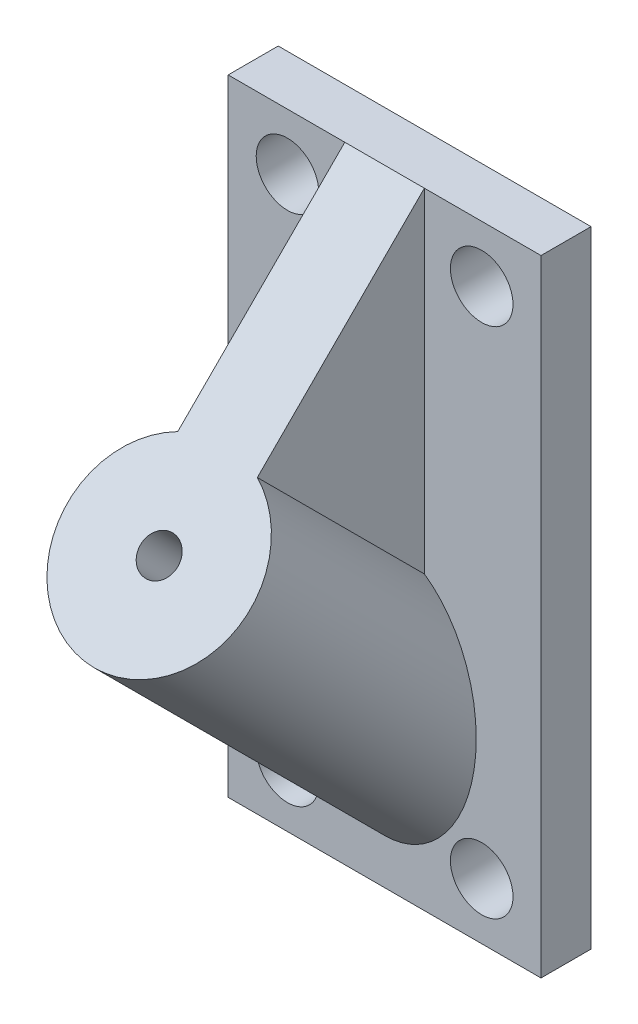
ISO-10303-21;
HEADER;
FILE_DESCRIPTION(('STEP AP214'),'2;1');
FILE_NAME('part.step','',(''),(''),'','','');
FILE_SCHEMA(('AUTOMOTIVE_DESIGN { 1 0 10303 214 1 1 1 1 }'));
ENDSEC;
DATA;
#1=APPLICATION_CONTEXT('core data for automotive mechanical design processes');
#2=APPLICATION_PROTOCOL_DEFINITION('international standard','automotive_design',2000,#1);
#3=PRODUCT_CONTEXT('',#1,'mechanical');
#4=PRODUCT('Part','Part','',(#3));
#5=PRODUCT_RELATED_PRODUCT_CATEGORY('part','',(#4));
#6=PRODUCT_DEFINITION_FORMATION('','',#4);
#7=PRODUCT_DEFINITION_CONTEXT('part definition',#1,'design');
#8=PRODUCT_DEFINITION('design','',#6,#7);
#9=PRODUCT_DEFINITION_SHAPE('','',#8);
#10=(LENGTH_UNIT() NAMED_UNIT(*) SI_UNIT(.MILLI.,.METRE.));
#11=(NAMED_UNIT(*) PLANE_ANGLE_UNIT() SI_UNIT($,.RADIAN.));
#12=(NAMED_UNIT(*) SI_UNIT($,.STERADIAN.) SOLID_ANGLE_UNIT());
#13=UNCERTAINTY_MEASURE_WITH_UNIT(LENGTH_MEASURE(1.E-05),#10,'distance_accuracy_value','');
#14=(GEOMETRIC_REPRESENTATION_CONTEXT(3) GLOBAL_UNCERTAINTY_ASSIGNED_CONTEXT((#13)) GLOBAL_UNIT_ASSIGNED_CONTEXT((#10,
#11,#12)) REPRESENTATION_CONTEXT('',''));
#15=CARTESIAN_POINT('',(0.,0.,0.));
#16=DIRECTION('',(0.,0.,1.));
#17=DIRECTION('',(1.,0.,0.));
#18=AXIS2_PLACEMENT_3D('',#15,#16,#17);
#19=CARTESIAN_POINT('',(0.,0.,2.));
#20=DIRECTION('',(0.,0.,-1.));
#21=DIRECTION('',(-1.,0.,0.));
#22=AXIS2_PLACEMENT_3D('',#19,#20,#21);
#23=PLANE('',#22);
#24=CARTESIAN_POINT('',(-7.76010006540054,-20.4945717108273,2.));
#25=DIRECTION('',(0.,0.,-1.));
#26=DIRECTION('',(-1.,0.,0.));
#27=AXIS2_PLACEMENT_3D('',#24,#25,#26);
#28=CIRCLE('',#27,2.5);
#29=CARTESIAN_POINT('',(-10.2601000654005,-20.4945717108273,2.));
#30=VERTEX_POINT('',#29);
#31=EDGE_CURVE('E234',#30,#30,#28,.T.);
#32=ORIENTED_EDGE('',*,*,#31,.T.);
#33=EDGE_LOOP('',(#32));
#34=FACE_BOUND('',#33,.T.);
#35=CARTESIAN_POINT('',(7.76010006540054,-20.4945717108273,2.));
#36=DIRECTION('',(0.,0.,-1.));
#37=DIRECTION('',(-1.,0.,0.));
#38=AXIS2_PLACEMENT_3D('',#35,#36,#37);
#39=CIRCLE('',#38,2.5);
#40=CARTESIAN_POINT('',(5.26010006540054,-20.4945717108273,2.));
#41=VERTEX_POINT('',#40);
#42=EDGE_CURVE('E246',#41,#41,#39,.T.);
#43=ORIENTED_EDGE('',*,*,#42,.T.);
#44=EDGE_LOOP('',(#43));
#45=FACE_BOUND('',#44,.T.);
#46=CARTESIAN_POINT('',(7.76010006540054,20.4945717108273,2.));
#47=DIRECTION('',(0.,0.,-1.));
#48=DIRECTION('',(-1.,0.,0.));
#49=AXIS2_PLACEMENT_3D('',#46,#47,#48);
#50=CIRCLE('',#49,2.5);
#51=CARTESIAN_POINT('',(5.26010006540054,20.4945717108273,2.));
#52=VERTEX_POINT('',#51);
#53=EDGE_CURVE('E249',#52,#52,#50,.T.);
#54=ORIENTED_EDGE('',*,*,#53,.T.);
#55=EDGE_LOOP('',(#54));
#56=FACE_BOUND('',#55,.T.);
#57=CARTESIAN_POINT('',(-7.76010006540054,20.4945717108273,2.));
#58=DIRECTION('',(0.,0.,-1.));
#59=DIRECTION('',(-1.,0.,0.));
#60=AXIS2_PLACEMENT_3D('',#57,#58,#59);
#61=CIRCLE('',#60,2.5);
#62=CARTESIAN_POINT('',(-10.2601000654005,20.4945717108273,2.));
#63=VERTEX_POINT('',#62);
#64=EDGE_CURVE('E252',#63,#63,#61,.T.);
#65=ORIENTED_EDGE('',*,*,#64,.T.);
#66=EDGE_LOOP('',(#65));
#67=FACE_BOUND('',#66,.T.);
#68=DIRECTION('',(0.,-1.,0.));
#69=VECTOR('',#68,1.);
#70=CARTESIAN_POINT('',(3.17957762170846,11.6503490315334,2.));
#71=LINE('',#70,#69);
#72=CARTESIAN_POINT('',(3.17957762170846,25.,2.));
#73=VERTEX_POINT('',#72);
#74=CARTESIAN_POINT('',(3.17957762170846,-1.6993019369335,2.));
#75=VERTEX_POINT('',#74);
#76=EDGE_CURVE('E169',#73,#75,#71,.T.);
#77=ORIENTED_EDGE('',*,*,#76,.T.);
#78=CARTESIAN_POINT('',(0.,-11.0295408923976,2.));
#79=DIRECTION('',(0.,0.,-1.));
#80=DIRECTION('',(0.,-1.,0.));
#81=AXIS2_PLACEMENT_3D('',#78,#79,#80);
#82=ELLIPSE('',#81,10.3572576810176,7.32368714074396);
#83=CARTESIAN_POINT('',(-3.17957762170846,-1.6993019369335,2.));
#84=VERTEX_POINT('',#83);
#85=EDGE_CURVE('E157',#84,#75,#82,.F.);
#86=ORIENTED_EDGE('',*,*,#85,.F.);
#87=DIRECTION('',(0.,-1.,0.));
#88=VECTOR('',#87,1.);
#89=CARTESIAN_POINT('',(-3.17957762170846,11.6503490315334,2.));
#90=LINE('',#89,#88);
#91=CARTESIAN_POINT('',(-3.17957762170846,25.,2.));
#92=VERTEX_POINT('',#91);
#93=EDGE_CURVE('E102',#92,#84,#90,.T.);
#94=ORIENTED_EDGE('',*,*,#93,.F.);
#95=DIRECTION('',(-1.,0.,0.));
#96=VECTOR('',#95,1.);
#97=CARTESIAN_POINT('',(-12.5,25.,2.));
#98=LINE('',#97,#96);
#99=CARTESIAN_POINT('',(-12.5,25.,2.));
#100=VERTEX_POINT('',#99);
#101=EDGE_CURVE('E88',#92,#100,#98,.T.);
#102=ORIENTED_EDGE('',*,*,#101,.T.);
#103=DIRECTION('',(0.,-1.,0.));
#104=VECTOR('',#103,1.);
#105=CARTESIAN_POINT('',(-12.5,-25.,2.));
#106=LINE('',#105,#104);
#107=CARTESIAN_POINT('',(-12.5,-25.,2.));
#108=VERTEX_POINT('',#107);
#109=EDGE_CURVE('E191',#100,#108,#106,.T.);
#110=ORIENTED_EDGE('',*,*,#109,.T.);
#111=DIRECTION('',(1.,0.,0.));
#112=VECTOR('',#111,1.);
#113=CARTESIAN_POINT('',(-12.5,-25.,2.));
#114=LINE('',#113,#112);
#115=CARTESIAN_POINT('',(12.5,-25.,2.));
#116=VERTEX_POINT('',#115);
#117=EDGE_CURVE('E209',#108,#116,#114,.T.);
#118=ORIENTED_EDGE('',*,*,#117,.T.);
#119=DIRECTION('',(0.,1.,0.));
#120=VECTOR('',#119,1.);
#121=CARTESIAN_POINT('',(12.5,-25.,2.));
#122=LINE('',#121,#120);
#123=CARTESIAN_POINT('',(12.5,25.,2.));
#124=VERTEX_POINT('',#123);
#125=EDGE_CURVE('E186',#116,#124,#122,.T.);
#126=ORIENTED_EDGE('',*,*,#125,.T.);
#127=EDGE_CURVE('E194',#124,#73,#98,.T.);
#128=ORIENTED_EDGE('',*,*,#127,.T.);
#129=EDGE_LOOP('',(#77,#86,#94,#102,#110,#118,#126,#128));
#130=FACE_BOUND('',#129,.T.);
#131=ADVANCED_FACE('F84',(#34,#45,#56,#67,#130),#23,.F.);
#132=CARTESIAN_POINT('',(0.,6.98522955380144,20.0147704461988));
#133=DIRECTION('',(0.,-0.707106781186551,-0.707106781186543));
#134=DIRECTION('',(0.,0.707106781186544,-0.707106781186551));
#135=AXIS2_PLACEMENT_3D('',#132,#133,#134);
#136=CYLINDRICAL_SURFACE('',#135,7.32368714074396);
#137=ORIENTED_EDGE('',*,*,#85,.T.);
#138=DIRECTION('',(0.,-0.707106781186551,-0.707106781186544));
#139=VECTOR('',#138,1.);
#140=CARTESIAN_POINT('',(3.17957762170847,11.6503490315334,15.3496509684667));
#141=LINE('',#140,#139);
#142=CARTESIAN_POINT('',(3.17957762170847,11.6503490315334,15.3496509684668));
#143=VERTEX_POINT('',#142);
#144=EDGE_CURVE('E153',#143,#75,#141,.T.);
#145=ORIENTED_EDGE('',*,*,#144,.F.);
#146=CARTESIAN_POINT('',(0.,6.98522955380144,20.0147704461988));
#147=DIRECTION('',(0.,-0.707106781186551,-0.707106781186544));
#148=DIRECTION('',(0.,0.707106781186544,-0.707106781186551));
#149=AXIS2_PLACEMENT_3D('',#146,#147,#148);
#150=CIRCLE('',#149,7.32368714074396);
#151=CARTESIAN_POINT('',(-3.17957762170846,11.6503490315334,15.3496509684667));
#152=VERTEX_POINT('',#151);
#153=EDGE_CURVE('E146',#143,#152,#150,.T.);
#154=ORIENTED_EDGE('',*,*,#153,.T.);
#155=DIRECTION('',(0.,-0.707106781186551,-0.707106781186544));
#156=VECTOR('',#155,1.);
#157=CARTESIAN_POINT('',(-3.17957762170846,11.6503490315334,15.3496509684667));
#158=LINE('',#157,#156);
#159=EDGE_CURVE('E151',#152,#84,#158,.T.);
#160=ORIENTED_EDGE('',*,*,#159,.T.);
#161=EDGE_LOOP('',(#137,#145,#154,#160));
#162=FACE_BOUND('',#161,.T.);
#163=ADVANCED_FACE('F149',(#162),#136,.T.);
#164=CARTESIAN_POINT('',(12.5,-25.,2.));
#165=DIRECTION('',(-1.,0.,0.));
#166=DIRECTION('',(0.,0.,1.));
#167=AXIS2_PLACEMENT_3D('',#164,#165,#166);
#168=PLANE('',#167);
#169=DIRECTION('',(0.,1.,0.));
#170=VECTOR('',#169,1.);
#171=CARTESIAN_POINT('',(12.5,-25.,-2.));
#172=LINE('',#171,#170);
#173=CARTESIAN_POINT('',(12.5,-25.,-2.));
#174=VERTEX_POINT('',#173);
#175=CARTESIAN_POINT('',(12.5,25.,-2.));
#176=VERTEX_POINT('',#175);
#177=EDGE_CURVE('E184',#174,#176,#172,.T.);
#178=ORIENTED_EDGE('',*,*,#177,.T.);
#179=DIRECTION('',(0.,0.,-1.));
#180=VECTOR('',#179,1.);
#181=CARTESIAN_POINT('',(12.5,25.,2.));
#182=LINE('',#181,#180);
#183=EDGE_CURVE('E94',#124,#176,#182,.T.);
#184=ORIENTED_EDGE('',*,*,#183,.F.);
#185=ORIENTED_EDGE('',*,*,#125,.F.);
#186=DIRECTION('',(0.,0.,-1.));
#187=VECTOR('',#186,1.);
#188=CARTESIAN_POINT('',(12.5,-25.,2.));
#189=LINE('',#188,#187);
#190=EDGE_CURVE('E206',#116,#174,#189,.T.);
#191=ORIENTED_EDGE('',*,*,#190,.T.);
#192=EDGE_LOOP('',(#178,#184,#185,#191));
#193=FACE_BOUND('',#192,.T.);
#194=ADVANCED_FACE('F86',(#193),#168,.F.);
#195=CARTESIAN_POINT('',(-12.5,25.,2.));
#196=DIRECTION('',(0.,-1.,0.));
#197=DIRECTION('',(0.,0.,-1.));
#198=AXIS2_PLACEMENT_3D('',#195,#196,#197);
#199=PLANE('',#198);
#200=DIRECTION('',(-1.,0.,0.));
#201=VECTOR('',#200,1.);
#202=CARTESIAN_POINT('',(-12.5,25.,-2.));
#203=LINE('',#202,#201);
#204=CARTESIAN_POINT('',(-12.5,25.,-2.));
#205=VERTEX_POINT('',#204);
#206=EDGE_CURVE('E213',#176,#205,#203,.T.);
#207=ORIENTED_EDGE('',*,*,#206,.T.);
#208=DIRECTION('',(0.,0.,-1.));
#209=VECTOR('',#208,1.);
#210=CARTESIAN_POINT('',(-12.5,25.,2.));
#211=LINE('',#210,#209);
#212=EDGE_CURVE('E200',#100,#205,#211,.T.);
#213=ORIENTED_EDGE('',*,*,#212,.F.);
#214=ORIENTED_EDGE('',*,*,#101,.F.);
#215=DIRECTION('',(1.,0.,0.));
#216=VECTOR('',#215,1.);
#217=CARTESIAN_POINT('',(-3.17957762170846,25.,2.));
#218=LINE('',#217,#216);
#219=EDGE_CURVE('E109',#92,#73,#218,.T.);
#220=ORIENTED_EDGE('',*,*,#219,.T.);
#221=ORIENTED_EDGE('',*,*,#127,.F.);
#222=ORIENTED_EDGE('',*,*,#183,.T.);
#223=EDGE_LOOP('',(#207,#213,#214,#220,#221,#222));
#224=FACE_BOUND('',#223,.T.);
#225=ADVANCED_FACE('F314',(#224),#199,.F.);
#226=CARTESIAN_POINT('',(-12.5,-25.,2.));
#227=DIRECTION('',(1.,0.,0.));
#228=DIRECTION('',(0.,0.,-1.));
#229=AXIS2_PLACEMENT_3D('',#226,#227,#228);
#230=PLANE('',#229);
#231=DIRECTION('',(0.,-1.,0.));
#232=VECTOR('',#231,1.);
#233=CARTESIAN_POINT('',(-12.5,-25.,-2.));
#234=LINE('',#233,#232);
#235=CARTESIAN_POINT('',(-12.5,-25.,-2.));
#236=VERTEX_POINT('',#235);
#237=EDGE_CURVE('E211',#205,#236,#234,.T.);
#238=ORIENTED_EDGE('',*,*,#237,.T.);
#239=DIRECTION('',(0.,0.,-1.));
#240=VECTOR('',#239,1.);
#241=CARTESIAN_POINT('',(-12.5,-25.,2.));
#242=LINE('',#241,#240);
#243=EDGE_CURVE('E203',#108,#236,#242,.T.);
#244=ORIENTED_EDGE('',*,*,#243,.F.);
#245=ORIENTED_EDGE('',*,*,#109,.F.);
#246=ORIENTED_EDGE('',*,*,#212,.T.);
#247=EDGE_LOOP('',(#238,#244,#245,#246));
#248=FACE_BOUND('',#247,.T.);
#249=ADVANCED_FACE('F222',(#248),#230,.F.);
#250=CARTESIAN_POINT('',(-12.5,-25.,2.));
#251=DIRECTION('',(0.,1.,0.));
#252=DIRECTION('',(0.,0.,1.));
#253=AXIS2_PLACEMENT_3D('',#250,#251,#252);
#254=PLANE('',#253);
#255=DIRECTION('',(1.,0.,0.));
#256=VECTOR('',#255,1.);
#257=CARTESIAN_POINT('',(-12.5,-25.,-2.));
#258=LINE('',#257,#256);
#259=EDGE_CURVE('E188',#236,#174,#258,.T.);
#260=ORIENTED_EDGE('',*,*,#259,.T.);
#261=ORIENTED_EDGE('',*,*,#190,.F.);
#262=ORIENTED_EDGE('',*,*,#117,.F.);
#263=ORIENTED_EDGE('',*,*,#243,.T.);
#264=EDGE_LOOP('',(#260,#261,#262,#263));
#265=FACE_BOUND('',#264,.T.);
#266=ADVANCED_FACE('F226',(#265),#254,.F.);
#267=CARTESIAN_POINT('',(0.,0.,-2.));
#268=DIRECTION('',(0.,0.,-1.));
#269=DIRECTION('',(-1.,0.,0.));
#270=AXIS2_PLACEMENT_3D('',#267,#268,#269);
#271=PLANE('',#270);
#272=CARTESIAN_POINT('',(-7.76010006540054,-20.4945717108273,-2.));
#273=DIRECTION('',(0.,0.,1.));
#274=DIRECTION('',(1.,0.,0.));
#275=AXIS2_PLACEMENT_3D('',#272,#273,#274);
#276=CIRCLE('',#275,2.5);
#277=CARTESIAN_POINT('',(-5.26010006540054,-20.4945717108273,-2.));
#278=VERTEX_POINT('',#277);
#279=EDGE_CURVE('E259',#278,#278,#276,.T.);
#280=ORIENTED_EDGE('',*,*,#279,.T.);
#281=EDGE_LOOP('',(#280));
#282=FACE_BOUND('',#281,.T.);
#283=CARTESIAN_POINT('',(7.76010006540054,-20.4945717108273,-2.));
#284=DIRECTION('',(0.,0.,1.));
#285=DIRECTION('',(1.,0.,0.));
#286=AXIS2_PLACEMENT_3D('',#283,#284,#285);
#287=CIRCLE('',#286,2.5);
#288=CARTESIAN_POINT('',(10.2601000654005,-20.4945717108273,-2.));
#289=VERTEX_POINT('',#288);
#290=EDGE_CURVE('E262',#289,#289,#287,.T.);
#291=ORIENTED_EDGE('',*,*,#290,.T.);
#292=EDGE_LOOP('',(#291));
#293=FACE_BOUND('',#292,.T.);
#294=CARTESIAN_POINT('',(7.76010006540054,20.4945717108273,-2.));
#295=DIRECTION('',(0.,0.,1.));
#296=DIRECTION('',(1.,0.,0.));
#297=AXIS2_PLACEMENT_3D('',#294,#295,#296);
#298=CIRCLE('',#297,2.5);
#299=CARTESIAN_POINT('',(10.2601000654005,20.4945717108273,-2.));
#300=VERTEX_POINT('',#299);
#301=EDGE_CURVE('E258',#300,#300,#298,.T.);
#302=ORIENTED_EDGE('',*,*,#301,.T.);
#303=EDGE_LOOP('',(#302));
#304=FACE_BOUND('',#303,.T.);
#305=CARTESIAN_POINT('',(-7.76010006540054,20.4945717108273,-2.));
#306=DIRECTION('',(0.,0.,1.));
#307=DIRECTION('',(1.,0.,0.));
#308=AXIS2_PLACEMENT_3D('',#305,#306,#307);
#309=CIRCLE('',#308,2.5);
#310=CARTESIAN_POINT('',(-5.26010006540054,20.4945717108273,-2.));
#311=VERTEX_POINT('',#310);
#312=EDGE_CURVE('E255',#311,#311,#309,.T.);
#313=ORIENTED_EDGE('',*,*,#312,.T.);
#314=EDGE_LOOP('',(#313));
#315=FACE_BOUND('',#314,.T.);
#316=ORIENTED_EDGE('',*,*,#177,.F.);
#317=ORIENTED_EDGE('',*,*,#259,.F.);
#318=ORIENTED_EDGE('',*,*,#237,.F.);
#319=ORIENTED_EDGE('',*,*,#206,.F.);
#320=EDGE_LOOP('',(#316,#317,#318,#319));
#321=FACE_BOUND('',#320,.T.);
#322=ADVANCED_FACE('F268',(#282,#293,#304,#315,#321),#271,.T.);
#323=CARTESIAN_POINT('',(0.,6.98522955380144,20.0147704461988));
#324=DIRECTION('',(0.,-0.707106781186551,-0.707106781186543));
#325=DIRECTION('',(0.,0.707106781186544,-0.707106781186551));
#326=AXIS2_PLACEMENT_3D('',#323,#324,#325);
#327=CYLINDRICAL_SURFACE('',#326,1.5);
#328=CARTESIAN_POINT('',(0.,6.98522955380144,20.0147704461988));
#329=DIRECTION('',(0.,-0.707106781186552,-0.707106781186543));
#330=DIRECTION('',(0.,0.707106781186543,-0.707106781186552));
#331=AXIS2_PLACEMENT_3D('',#328,#329,#330);
#332=CIRCLE('',#331,1.5);
#333=CARTESIAN_POINT('',(0.,8.04588972558125,18.954110274419));
#334=VERTEX_POINT('',#333);
#335=EDGE_CURVE('E181',#334,#334,#332,.T.);
#336=ORIENTED_EDGE('',*,*,#335,.F.);
#337=EDGE_LOOP('',(#336));
#338=FACE_BOUND('',#337,.T.);
#339=CARTESIAN_POINT('',(0.,-11.0295408923976,2.));
#340=DIRECTION('',(0.,0.,-1.));
#341=DIRECTION('',(0.,-1.,0.));
#342=AXIS2_PLACEMENT_3D('',#339,#340,#341);
#343=ELLIPSE('',#342,2.12132034355965,1.5);
#344=CARTESIAN_POINT('',(0.,-13.1508612359572,2.));
#345=VERTEX_POINT('',#344);
#346=EDGE_CURVE('E12',#345,#345,#343,.T.);
#347=ORIENTED_EDGE('',*,*,#346,.T.);
#348=EDGE_LOOP('',(#347));
#349=FACE_BOUND('',#348,.T.);
#350=ADVANCED_FACE('F302',(#338,#349),#327,.F.);
#351=CARTESIAN_POINT('',(0.,13.4999999944542,13.500000015891));
#352=DIRECTION('',(0.,-0.707106780625136,-0.707106781747959));
#353=DIRECTION('',(0.,0.707106781747959,-0.707106780625136));
#354=AXIS2_PLACEMENT_3D('',#351,#352,#353);
#355=PLANE('',#354);
#356=ORIENTED_EDGE('',*,*,#153,.F.);
#357=DIRECTION('',(0.,0.707106781186544,-0.707106781186551));
#358=VECTOR('',#357,1.);
#359=CARTESIAN_POINT('',(3.17957762170847,11.6503490315334,15.3496509684667));
#360=LINE('',#359,#358);
#361=EDGE_CURVE('E164',#143,#73,#360,.T.);
#362=ORIENTED_EDGE('',*,*,#361,.T.);
#363=ORIENTED_EDGE('',*,*,#219,.F.);
#364=DIRECTION('',(0.,0.707106781186544,-0.707106781186551));
#365=VECTOR('',#364,1.);
#366=CARTESIAN_POINT('',(-3.17957762170846,11.6503490315334,15.3496509684667));
#367=LINE('',#366,#365);
#368=EDGE_CURVE('E160',#152,#92,#367,.T.);
#369=ORIENTED_EDGE('',*,*,#368,.F.);
#370=EDGE_LOOP('',(#356,#362,#363,#369));
#371=FACE_BOUND('',#370,.T.);
#372=ORIENTED_EDGE('',*,*,#335,.T.);
#373=EDGE_LOOP('',(#372));
#374=FACE_BOUND('',#373,.T.);
#375=ADVANCED_FACE('F161',(#371,#374),#355,.F.);
#376=ORIENTED_EDGE('',*,*,#346,.F.);
#377=EDGE_LOOP('',(#376));
#378=FACE_BOUND('',#377,.T.);
#379=ADVANCED_FACE('F283',(#378),#23,.F.);
#380=CARTESIAN_POINT('',(3.17957762170847,11.6503490315334,15.3496509684667));
#381=DIRECTION('',(-1.,0.,0.));
#382=DIRECTION('',(0.,0.,1.));
#383=AXIS2_PLACEMENT_3D('',#380,#381,#382);
#384=PLANE('',#383);
#385=ORIENTED_EDGE('',*,*,#76,.F.);
#386=ORIENTED_EDGE('',*,*,#361,.F.);
#387=ORIENTED_EDGE('',*,*,#144,.T.);
#388=EDGE_LOOP('',(#385,#386,#387));
#389=FACE_BOUND('',#388,.T.);
#390=ADVANCED_FACE('F233',(#389),#384,.F.);
#391=CARTESIAN_POINT('',(-3.17957762170846,11.6503490315334,15.3496509684667));
#392=DIRECTION('',(-1.,0.,0.));
#393=DIRECTION('',(0.,0.,1.));
#394=AXIS2_PLACEMENT_3D('',#391,#392,#393);
#395=PLANE('',#394);
#396=ORIENTED_EDGE('',*,*,#368,.T.);
#397=ORIENTED_EDGE('',*,*,#93,.T.);
#398=ORIENTED_EDGE('',*,*,#159,.F.);
#399=EDGE_LOOP('',(#396,#397,#398));
#400=FACE_BOUND('',#399,.T.);
#401=ADVANCED_FACE('F166',(#400),#395,.T.);
#402=CARTESIAN_POINT('',(-7.76010006540054,20.4945717108273,-2.));
#403=DIRECTION('',(0.,0.,1.));
#404=DIRECTION('',(1.,0.,0.));
#405=AXIS2_PLACEMENT_3D('',#402,#403,#404);
#406=CYLINDRICAL_SURFACE('',#405,2.5);
#407=ORIENTED_EDGE('',*,*,#312,.F.);
#408=EDGE_LOOP('',(#407));
#409=FACE_BOUND('',#408,.T.);
#410=ORIENTED_EDGE('',*,*,#64,.F.);
#411=EDGE_LOOP('',(#410));
#412=FACE_BOUND('',#411,.T.);
#413=ADVANCED_FACE('F275',(#409,#412),#406,.F.);
#414=CARTESIAN_POINT('',(7.76010006540054,20.4945717108273,-2.));
#415=DIRECTION('',(0.,0.,1.));
#416=DIRECTION('',(1.,0.,0.));
#417=AXIS2_PLACEMENT_3D('',#414,#415,#416);
#418=CYLINDRICAL_SURFACE('',#417,2.5);
#419=ORIENTED_EDGE('',*,*,#301,.F.);
#420=EDGE_LOOP('',(#419));
#421=FACE_BOUND('',#420,.T.);
#422=ORIENTED_EDGE('',*,*,#53,.F.);
#423=EDGE_LOOP('',(#422));
#424=FACE_BOUND('',#423,.T.);
#425=ADVANCED_FACE('F271',(#421,#424),#418,.F.);
#426=CARTESIAN_POINT('',(7.76010006540054,-20.4945717108273,-2.));
#427=DIRECTION('',(0.,0.,1.));
#428=DIRECTION('',(1.,0.,0.));
#429=AXIS2_PLACEMENT_3D('',#426,#427,#428);
#430=CYLINDRICAL_SURFACE('',#429,2.5);
#431=ORIENTED_EDGE('',*,*,#290,.F.);
#432=EDGE_LOOP('',(#431));
#433=FACE_BOUND('',#432,.T.);
#434=ORIENTED_EDGE('',*,*,#42,.F.);
#435=EDGE_LOOP('',(#434));
#436=FACE_BOUND('',#435,.T.);
#437=ADVANCED_FACE('F274',(#433,#436),#430,.F.);
#438=CARTESIAN_POINT('',(-7.76010006540054,-20.4945717108273,-2.));
#439=DIRECTION('',(0.,0.,1.));
#440=DIRECTION('',(1.,0.,0.));
#441=AXIS2_PLACEMENT_3D('',#438,#439,#440);
#442=CYLINDRICAL_SURFACE('',#441,2.5);
#443=ORIENTED_EDGE('',*,*,#279,.F.);
#444=EDGE_LOOP('',(#443));
#445=FACE_BOUND('',#444,.T.);
#446=ORIENTED_EDGE('',*,*,#31,.F.);
#447=EDGE_LOOP('',(#446));
#448=FACE_BOUND('',#447,.T.);
#449=ADVANCED_FACE('F295',(#445,#448),#442,.F.);
#450=CLOSED_SHELL('',(#131,#163,#194,#225,#249,#266,#322,#350,#375,#379,#390,#401,#413,#425,
#437,#449));
#451=MANIFOLD_SOLID_BREP('B2',#450);
#452=ADVANCED_BREP_SHAPE_REPRESENTATION('',(#18,#451),#14);
#453=SHAPE_DEFINITION_REPRESENTATION(#9,#452);
ENDSEC;
END-ISO-10303-21;
